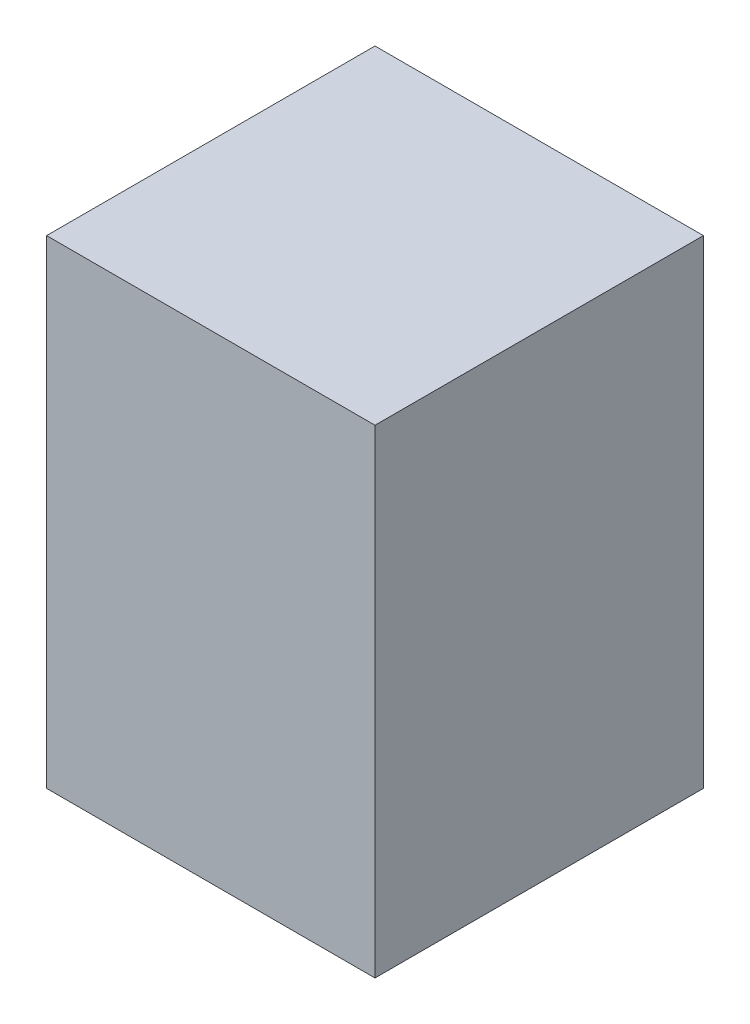
ISO-10303-21;
HEADER;
FILE_DESCRIPTION(('STEP AP214'),'2;1');
FILE_NAME('part.step','',(''),(''),'','','');
FILE_SCHEMA(('AUTOMOTIVE_DESIGN { 1 0 10303 214 1 1 1 1 }'));
ENDSEC;
DATA;
#1=APPLICATION_CONTEXT('core data for automotive mechanical design processes');
#2=APPLICATION_PROTOCOL_DEFINITION('international standard','automotive_design',2000,#1);
#3=PRODUCT_CONTEXT('',#1,'mechanical');
#4=PRODUCT('Part','Part','',(#3));
#5=PRODUCT_RELATED_PRODUCT_CATEGORY('part','',(#4));
#6=PRODUCT_DEFINITION_FORMATION('','',#4);
#7=PRODUCT_DEFINITION_CONTEXT('part definition',#1,'design');
#8=PRODUCT_DEFINITION('design','',#6,#7);
#9=PRODUCT_DEFINITION_SHAPE('','',#8);
#10=(LENGTH_UNIT() NAMED_UNIT(*) SI_UNIT(.MILLI.,.METRE.));
#11=(NAMED_UNIT(*) PLANE_ANGLE_UNIT() SI_UNIT($,.RADIAN.));
#12=(NAMED_UNIT(*) SI_UNIT($,.STERADIAN.) SOLID_ANGLE_UNIT());
#13=UNCERTAINTY_MEASURE_WITH_UNIT(LENGTH_MEASURE(1.E-05),#10,'distance_accuracy_value','');
#14=(GEOMETRIC_REPRESENTATION_CONTEXT(3) GLOBAL_UNCERTAINTY_ASSIGNED_CONTEXT((#13)) GLOBAL_UNIT_ASSIGNED_CONTEXT((#10,
#11,#12)) REPRESENTATION_CONTEXT('',''));
#15=CARTESIAN_POINT('',(0.,0.,0.));
#16=DIRECTION('',(0.,0.,1.));
#17=DIRECTION('',(1.,0.,0.));
#18=AXIS2_PLACEMENT_3D('',#15,#16,#17);
#19=CARTESIAN_POINT('',(171.5,-60.,171.5));
#20=DIRECTION('',(1.,0.,0.));
#21=DIRECTION('',(0.,0.,-1.));
#22=AXIS2_PLACEMENT_3D('',#19,#20,#21);
#23=PLANE('',#22);
#24=DIRECTION('',(0.,1.,0.));
#25=VECTOR('',#24,1.);
#26=CARTESIAN_POINT('',(171.5,-60.,-171.5));
#27=LINE('',#26,#25);
#28=CARTESIAN_POINT('',(171.5,-60.,-171.5));
#29=VERTEX_POINT('',#28);
#30=CARTESIAN_POINT('',(171.5,440.,-171.5));
#31=VERTEX_POINT('',#30);
#32=EDGE_CURVE('E46',#29,#31,#27,.T.);
#33=ORIENTED_EDGE('',*,*,#32,.T.);
#34=DIRECTION('',(0.,0.,-1.));
#35=VECTOR('',#34,1.);
#36=CARTESIAN_POINT('',(171.5,440.,171.5));
#37=LINE('',#36,#35);
#38=CARTESIAN_POINT('',(171.5,440.,171.5));
#39=VERTEX_POINT('',#38);
#40=EDGE_CURVE('E84',#39,#31,#37,.T.);
#41=ORIENTED_EDGE('',*,*,#40,.F.);
#42=DIRECTION('',(0.,1.,0.));
#43=VECTOR('',#42,1.);
#44=CARTESIAN_POINT('',(171.5,-60.,171.5));
#45=LINE('',#44,#43);
#46=CARTESIAN_POINT('',(171.5,-60.,171.5));
#47=VERTEX_POINT('',#46);
#48=EDGE_CURVE('E11',#47,#39,#45,.T.);
#49=ORIENTED_EDGE('',*,*,#48,.F.);
#50=DIRECTION('',(0.,0.,-1.));
#51=VECTOR('',#50,1.);
#52=CARTESIAN_POINT('',(171.5,-60.,171.5));
#53=LINE('',#52,#51);
#54=EDGE_CURVE('E85',#47,#29,#53,.T.);
#55=ORIENTED_EDGE('',*,*,#54,.T.);
#56=EDGE_LOOP('',(#33,#41,#49,#55));
#57=FACE_BOUND('',#56,.T.);
#58=ADVANCED_FACE('F43',(#57),#23,.T.);
#59=CARTESIAN_POINT('',(-171.5,-60.,171.5));
#60=DIRECTION('',(0.,0.,1.));
#61=DIRECTION('',(1.,0.,0.));
#62=AXIS2_PLACEMENT_3D('',#59,#60,#61);
#63=PLANE('',#62);
#64=ORIENTED_EDGE('',*,*,#48,.T.);
#65=DIRECTION('',(1.,0.,0.));
#66=VECTOR('',#65,1.);
#67=CARTESIAN_POINT('',(-171.5,440.,171.5));
#68=LINE('',#67,#66);
#69=CARTESIAN_POINT('',(-171.5,440.,171.5));
#70=VERTEX_POINT('',#69);
#71=EDGE_CURVE('E103',#70,#39,#68,.T.);
#72=ORIENTED_EDGE('',*,*,#71,.F.);
#73=DIRECTION('',(0.,1.,0.));
#74=VECTOR('',#73,1.);
#75=CARTESIAN_POINT('',(-171.5,-60.,171.5));
#76=LINE('',#75,#74);
#77=CARTESIAN_POINT('',(-171.5,-60.,171.5));
#78=VERTEX_POINT('',#77);
#79=EDGE_CURVE('E52',#78,#70,#76,.T.);
#80=ORIENTED_EDGE('',*,*,#79,.F.);
#81=DIRECTION('',(1.,0.,0.));
#82=VECTOR('',#81,1.);
#83=CARTESIAN_POINT('',(-171.5,-60.,171.5));
#84=LINE('',#83,#82);
#85=EDGE_CURVE('E91',#78,#47,#84,.T.);
#86=ORIENTED_EDGE('',*,*,#85,.T.);
#87=EDGE_LOOP('',(#64,#72,#80,#86));
#88=FACE_BOUND('',#87,.T.);
#89=ADVANCED_FACE('F127',(#88),#63,.T.);
#90=CARTESIAN_POINT('',(-171.5,-60.,171.5));
#91=DIRECTION('',(-1.,0.,0.));
#92=DIRECTION('',(0.,0.,1.));
#93=AXIS2_PLACEMENT_3D('',#90,#91,#92);
#94=PLANE('',#93);
#95=ORIENTED_EDGE('',*,*,#79,.T.);
#96=DIRECTION('',(0.,0.,1.));
#97=VECTOR('',#96,1.);
#98=CARTESIAN_POINT('',(-171.5,440.,171.5));
#99=LINE('',#98,#97);
#100=CARTESIAN_POINT('',(-171.5,440.,-171.5));
#101=VERTEX_POINT('',#100);
#102=EDGE_CURVE('E99',#101,#70,#99,.T.);
#103=ORIENTED_EDGE('',*,*,#102,.F.);
#104=DIRECTION('',(0.,1.,0.));
#105=VECTOR('',#104,1.);
#106=CARTESIAN_POINT('',(-171.5,-60.,-171.5));
#107=LINE('',#106,#105);
#108=CARTESIAN_POINT('',(-171.5,-60.,-171.5));
#109=VERTEX_POINT('',#108);
#110=EDGE_CURVE('E90',#109,#101,#107,.T.);
#111=ORIENTED_EDGE('',*,*,#110,.F.);
#112=DIRECTION('',(0.,0.,1.));
#113=VECTOR('',#112,1.);
#114=CARTESIAN_POINT('',(-171.5,-60.,171.5));
#115=LINE('',#114,#113);
#116=EDGE_CURVE('E116',#109,#78,#115,.T.);
#117=ORIENTED_EDGE('',*,*,#116,.T.);
#118=EDGE_LOOP('',(#95,#103,#111,#117));
#119=FACE_BOUND('',#118,.T.);
#120=ADVANCED_FACE('F124',(#119),#94,.T.);
#121=CARTESIAN_POINT('',(-171.5,-60.,-171.5));
#122=DIRECTION('',(0.,0.,-1.));
#123=DIRECTION('',(-1.,0.,0.));
#124=AXIS2_PLACEMENT_3D('',#121,#122,#123);
#125=PLANE('',#124);
#126=ORIENTED_EDGE('',*,*,#110,.T.);
#127=DIRECTION('',(-1.,0.,0.));
#128=VECTOR('',#127,1.);
#129=CARTESIAN_POINT('',(-171.5,440.,-171.5));
#130=LINE('',#129,#128);
#131=EDGE_CURVE('E93',#31,#101,#130,.T.);
#132=ORIENTED_EDGE('',*,*,#131,.F.);
#133=ORIENTED_EDGE('',*,*,#32,.F.);
#134=DIRECTION('',(-1.,0.,0.));
#135=VECTOR('',#134,1.);
#136=CARTESIAN_POINT('',(-171.5,-60.,-171.5));
#137=LINE('',#136,#135);
#138=EDGE_CURVE('E113',#29,#109,#137,.T.);
#139=ORIENTED_EDGE('',*,*,#138,.T.);
#140=EDGE_LOOP('',(#126,#132,#133,#139));
#141=FACE_BOUND('',#140,.T.);
#142=ADVANCED_FACE('F94',(#141),#125,.T.);
#143=CARTESIAN_POINT('',(0.,-60.,0.));
#144=DIRECTION('',(0.,-1.,0.));
#145=DIRECTION('',(0.,0.,-1.));
#146=AXIS2_PLACEMENT_3D('',#143,#144,#145);
#147=PLANE('',#146);
#148=ORIENTED_EDGE('',*,*,#54,.F.);
#149=ORIENTED_EDGE('',*,*,#85,.F.);
#150=ORIENTED_EDGE('',*,*,#116,.F.);
#151=ORIENTED_EDGE('',*,*,#138,.F.);
#152=EDGE_LOOP('',(#148,#149,#150,#151));
#153=FACE_BOUND('',#152,.T.);
#154=ADVANCED_FACE('F129',(#153),#147,.T.);
#155=CARTESIAN_POINT('',(0.,440.,0.));
#156=DIRECTION('',(0.,-1.,0.));
#157=DIRECTION('',(0.,0.,-1.));
#158=AXIS2_PLACEMENT_3D('',#155,#156,#157);
#159=PLANE('',#158);
#160=ORIENTED_EDGE('',*,*,#40,.T.);
#161=ORIENTED_EDGE('',*,*,#131,.T.);
#162=ORIENTED_EDGE('',*,*,#102,.T.);
#163=ORIENTED_EDGE('',*,*,#71,.T.);
#164=EDGE_LOOP('',(#160,#161,#162,#163));
#165=FACE_BOUND('',#164,.T.);
#166=ADVANCED_FACE('F102',(#165),#159,.F.);
#167=CLOSED_SHELL('',(#58,#89,#120,#142,#154,#166));
#168=MANIFOLD_SOLID_BREP('B2',#167);
#169=ADVANCED_BREP_SHAPE_REPRESENTATION('',(#18,#168),#14);
#170=SHAPE_DEFINITION_REPRESENTATION(#9,#169);
ENDSEC;
END-ISO-10303-21;
